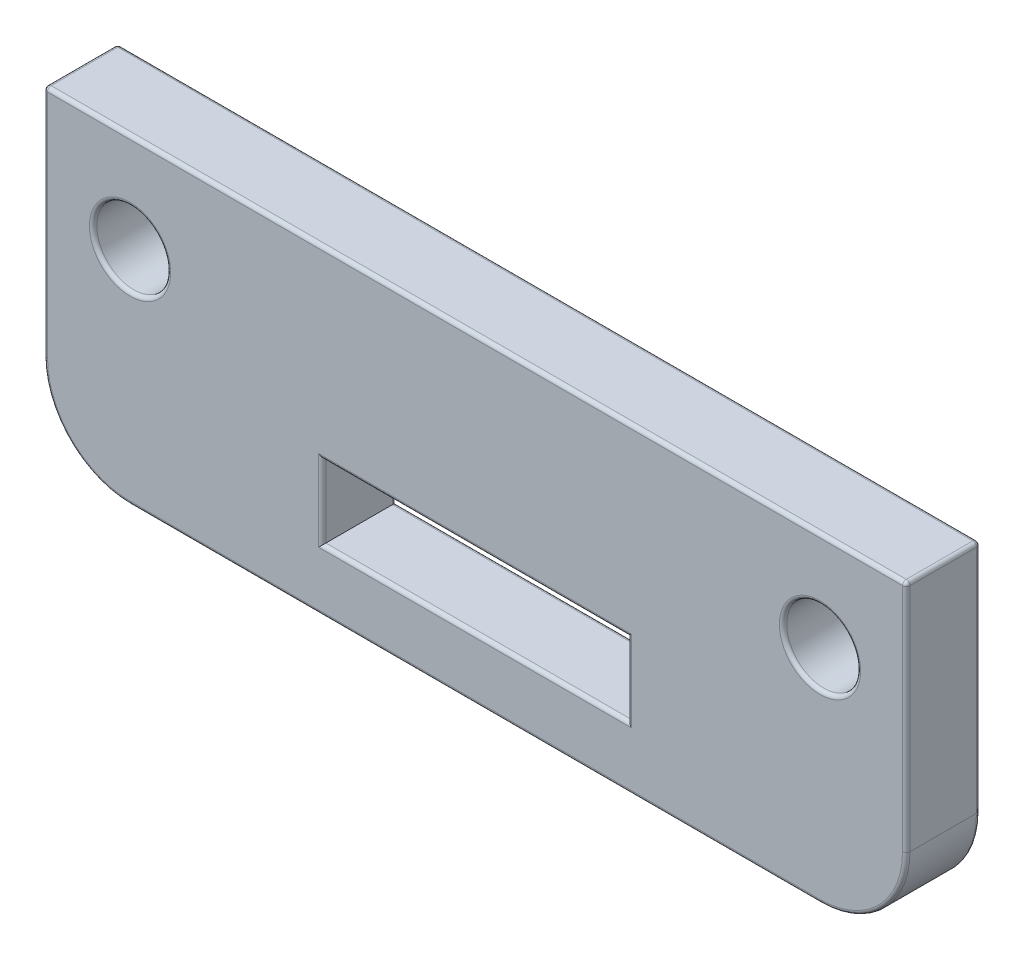
ISO-10303-21;
HEADER;
FILE_DESCRIPTION(('STEP AP214'),'2;1');
FILE_NAME('part.step','',(''),(''),'','','');
FILE_SCHEMA(('AUTOMOTIVE_DESIGN { 1 0 10303 214 1 1 1 1 }'));
ENDSEC;
DATA;
#1=APPLICATION_CONTEXT('core data for automotive mechanical design processes');
#2=APPLICATION_PROTOCOL_DEFINITION('international standard','automotive_design',2000,#1);
#3=PRODUCT_CONTEXT('',#1,'mechanical');
#4=PRODUCT('Part','Part','',(#3));
#5=PRODUCT_RELATED_PRODUCT_CATEGORY('part','',(#4));
#6=PRODUCT_DEFINITION_FORMATION('','',#4);
#7=PRODUCT_DEFINITION_CONTEXT('part definition',#1,'design');
#8=PRODUCT_DEFINITION('design','',#6,#7);
#9=PRODUCT_DEFINITION_SHAPE('','',#8);
#10=(LENGTH_UNIT() NAMED_UNIT(*) SI_UNIT(.MILLI.,.METRE.));
#11=(NAMED_UNIT(*) PLANE_ANGLE_UNIT() SI_UNIT($,.RADIAN.));
#12=(NAMED_UNIT(*) SI_UNIT($,.STERADIAN.) SOLID_ANGLE_UNIT());
#13=UNCERTAINTY_MEASURE_WITH_UNIT(LENGTH_MEASURE(1.E-05),#10,'distance_accuracy_value','');
#14=(GEOMETRIC_REPRESENTATION_CONTEXT(3) GLOBAL_UNCERTAINTY_ASSIGNED_CONTEXT((#13)) GLOBAL_UNIT_ASSIGNED_CONTEXT((#10,
#11,#12)) REPRESENTATION_CONTEXT('',''));
#15=CARTESIAN_POINT('',(0.,0.,0.));
#16=DIRECTION('',(0.,0.,1.));
#17=DIRECTION('',(1.,0.,0.));
#18=AXIS2_PLACEMENT_3D('',#15,#16,#17);
#19=CARTESIAN_POINT('',(0.,8.49264705882353,3.));
#20=DIRECTION('',(0.,0.,-1.));
#21=DIRECTION('',(-1.,0.,0.));
#22=AXIS2_PLACEMENT_3D('',#19,#20,#21);
#23=PLANE('',#22);
#24=CARTESIAN_POINT('',(14.,-15.5,3.));
#25=DIRECTION('',(0.,0.,-1.));
#26=DIRECTION('',(-1.,0.,0.));
#27=AXIS2_PLACEMENT_3D('',#24,#25,#26);
#28=CIRCLE('',#27,3.35);
#29=CARTESIAN_POINT('',(14.,-18.85,3.));
#30=VERTEX_POINT('',#29);
#31=CARTESIAN_POINT('',(17.35,-15.5,3.));
#32=VERTEX_POINT('',#31);
#33=EDGE_CURVE('E52',#30,#32,#28,.F.);
#34=ORIENTED_EDGE('',*,*,#33,.T.);
#35=DIRECTION('',(0.,1.,0.));
#36=VECTOR('',#35,1.);
#37=CARTESIAN_POINT('',(17.35,8.49264705882353,3.));
#38=LINE('',#37,#36);
#39=CARTESIAN_POINT('',(17.35,-6.15,3.));
#40=VERTEX_POINT('',#39);
#41=EDGE_CURVE('E11',#32,#40,#38,.T.);
#42=ORIENTED_EDGE('',*,*,#41,.T.);
#43=DIRECTION('',(1.,0.,0.));
#44=VECTOR('',#43,1.);
#45=CARTESIAN_POINT('',(-17.5,-6.15,3.));
#46=LINE('',#45,#44);
#47=CARTESIAN_POINT('',(-17.35,-6.15,3.));
#48=VERTEX_POINT('',#47);
#49=EDGE_CURVE('E383',#40,#48,#46,.F.);
#50=ORIENTED_EDGE('',*,*,#49,.T.);
#51=DIRECTION('',(0.,-1.,0.));
#52=VECTOR('',#51,1.);
#53=CARTESIAN_POINT('',(-17.35,8.49264705882353,3.));
#54=LINE('',#53,#52);
#55=CARTESIAN_POINT('',(-17.35,-15.5,3.));
#56=VERTEX_POINT('',#55);
#57=EDGE_CURVE('E386',#48,#56,#54,.T.);
#58=ORIENTED_EDGE('',*,*,#57,.T.);
#59=CARTESIAN_POINT('',(-14.,-15.5,3.));
#60=DIRECTION('',(0.,0.,-1.));
#61=DIRECTION('',(-1.,0.,0.));
#62=AXIS2_PLACEMENT_3D('',#59,#60,#61);
#63=CIRCLE('',#62,3.35);
#64=CARTESIAN_POINT('',(-14.,-18.85,3.));
#65=VERTEX_POINT('',#64);
#66=EDGE_CURVE('E389',#56,#65,#63,.F.);
#67=ORIENTED_EDGE('',*,*,#66,.T.);
#68=DIRECTION('',(1.,0.,0.));
#69=VECTOR('',#68,1.);
#70=CARTESIAN_POINT('',(0.,-18.85,3.));
#71=LINE('',#70,#69);
#72=EDGE_CURVE('E63',#65,#30,#71,.T.);
#73=ORIENTED_EDGE('',*,*,#72,.T.);
#74=EDGE_LOOP('',(#34,#42,#50,#58,#67,#73));
#75=FACE_BOUND('',#74,.T.);
#76=CARTESIAN_POINT('',(-14.,-10.,3.));
#77=DIRECTION('',(0.,0.,-1.));
#78=DIRECTION('',(-1.,0.,0.));
#79=AXIS2_PLACEMENT_3D('',#76,#77,#78);
#80=CIRCLE('',#79,1.65);
#81=CARTESIAN_POINT('',(-15.65,-10.,3.));
#82=VERTEX_POINT('',#81);
#83=EDGE_CURVE('E379',#82,#82,#80,.T.);
#84=ORIENTED_EDGE('',*,*,#83,.T.);
#85=EDGE_LOOP('',(#84));
#86=FACE_BOUND('',#85,.T.);
#87=DIRECTION('',(0.,1.,0.));
#88=VECTOR('',#87,1.);
#89=CARTESIAN_POINT('',(6.35,-16.5,3.));
#90=LINE('',#89,#88);
#91=CARTESIAN_POINT('',(6.35,-13.35,3.));
#92=VERTEX_POINT('',#91);
#93=CARTESIAN_POINT('',(6.35,-16.65,3.));
#94=VERTEX_POINT('',#93);
#95=EDGE_CURVE('E372',#92,#94,#90,.F.);
#96=ORIENTED_EDGE('',*,*,#95,.T.);
#97=DIRECTION('',(1.,0.,0.));
#98=VECTOR('',#97,1.);
#99=CARTESIAN_POINT('',(-6.2,-16.65,3.));
#100=LINE('',#99,#98);
#101=CARTESIAN_POINT('',(-6.35,-16.65,3.));
#102=VERTEX_POINT('',#101);
#103=EDGE_CURVE('E375',#94,#102,#100,.F.);
#104=ORIENTED_EDGE('',*,*,#103,.T.);
#105=DIRECTION('',(0.,-1.,0.));
#106=VECTOR('',#105,1.);
#107=CARTESIAN_POINT('',(-6.35,-13.5,3.));
#108=LINE('',#107,#106);
#109=CARTESIAN_POINT('',(-6.35,-13.35,3.));
#110=VERTEX_POINT('',#109);
#111=EDGE_CURVE('E366',#102,#110,#108,.F.);
#112=ORIENTED_EDGE('',*,*,#111,.T.);
#113=DIRECTION('',(-1.,0.,0.));
#114=VECTOR('',#113,1.);
#115=CARTESIAN_POINT('',(6.2,-13.35,3.));
#116=LINE('',#115,#114);
#117=EDGE_CURVE('E369',#110,#92,#116,.F.);
#118=ORIENTED_EDGE('',*,*,#117,.T.);
#119=EDGE_LOOP('',(#96,#104,#112,#118));
#120=FACE_BOUND('',#119,.T.);
#121=CARTESIAN_POINT('',(14.,-10.,3.));
#122=DIRECTION('',(0.,0.,-1.));
#123=DIRECTION('',(-1.,0.,0.));
#124=AXIS2_PLACEMENT_3D('',#121,#122,#123);
#125=CIRCLE('',#124,1.65);
#126=CARTESIAN_POINT('',(12.35,-10.,3.));
#127=VERTEX_POINT('',#126);
#128=EDGE_CURVE('E362',#127,#127,#125,.T.);
#129=ORIENTED_EDGE('',*,*,#128,.T.);
#130=EDGE_LOOP('',(#129));
#131=FACE_BOUND('',#130,.T.);
#132=ADVANCED_FACE('F42',(#75,#86,#120,#131),#23,.F.);
#133=CARTESIAN_POINT('',(0.,8.49264705882353,0.));
#134=DIRECTION('',(0.,0.,-1.));
#135=DIRECTION('',(-1.,0.,0.));
#136=AXIS2_PLACEMENT_3D('',#133,#134,#135);
#137=PLANE('',#136);
#138=DIRECTION('',(1.,0.,0.));
#139=VECTOR('',#138,1.);
#140=CARTESIAN_POINT('',(-14.,-18.85,0.));
#141=LINE('',#140,#139);
#142=CARTESIAN_POINT('',(14.,-18.85,0.));
#143=VERTEX_POINT('',#142);
#144=CARTESIAN_POINT('',(-14.,-18.85,0.));
#145=VERTEX_POINT('',#144);
#146=EDGE_CURVE('E295',#143,#145,#141,.F.);
#147=ORIENTED_EDGE('',*,*,#146,.T.);
#148=CARTESIAN_POINT('',(-14.,-15.5,0.));
#149=DIRECTION('',(0.,0.,-1.));
#150=DIRECTION('',(-1.,0.,0.));
#151=AXIS2_PLACEMENT_3D('',#148,#149,#150);
#152=CIRCLE('',#151,3.35);
#153=CARTESIAN_POINT('',(-17.35,-15.5,0.));
#154=VERTEX_POINT('',#153);
#155=EDGE_CURVE('E298',#145,#154,#152,.T.);
#156=ORIENTED_EDGE('',*,*,#155,.T.);
#157=DIRECTION('',(0.,-1.,0.));
#158=VECTOR('',#157,1.);
#159=CARTESIAN_POINT('',(-17.35,-6.,0.));
#160=LINE('',#159,#158);
#161=CARTESIAN_POINT('',(-17.35,-6.15,0.));
#162=VERTEX_POINT('',#161);
#163=EDGE_CURVE('E283',#154,#162,#160,.F.);
#164=ORIENTED_EDGE('',*,*,#163,.T.);
#165=DIRECTION('',(1.,0.,0.));
#166=VECTOR('',#165,1.);
#167=CARTESIAN_POINT('',(0.,-6.15,0.));
#168=LINE('',#167,#166);
#169=CARTESIAN_POINT('',(17.35,-6.15,0.));
#170=VERTEX_POINT('',#169);
#171=EDGE_CURVE('E286',#162,#170,#168,.T.);
#172=ORIENTED_EDGE('',*,*,#171,.T.);
#173=DIRECTION('',(0.,1.,0.));
#174=VECTOR('',#173,1.);
#175=CARTESIAN_POINT('',(17.35,-15.5,0.));
#176=LINE('',#175,#174);
#177=CARTESIAN_POINT('',(17.35,-15.5,0.));
#178=VERTEX_POINT('',#177);
#179=EDGE_CURVE('E289',#170,#178,#176,.F.);
#180=ORIENTED_EDGE('',*,*,#179,.T.);
#181=CARTESIAN_POINT('',(14.,-15.5,0.));
#182=DIRECTION('',(0.,0.,-1.));
#183=DIRECTION('',(-1.,0.,0.));
#184=AXIS2_PLACEMENT_3D('',#181,#182,#183);
#185=CIRCLE('',#184,3.35);
#186=EDGE_CURVE('E292',#178,#143,#185,.T.);
#187=ORIENTED_EDGE('',*,*,#186,.T.);
#188=EDGE_LOOP('',(#147,#156,#164,#172,#180,#187));
#189=FACE_BOUND('',#188,.T.);
#190=CARTESIAN_POINT('',(-14.,-10.,0.));
#191=DIRECTION('',(0.,0.,-1.));
#192=DIRECTION('',(-1.,0.,0.));
#193=AXIS2_PLACEMENT_3D('',#190,#191,#192);
#194=CIRCLE('',#193,1.65);
#195=CARTESIAN_POINT('',(-15.65,-10.,0.));
#196=VERTEX_POINT('',#195);
#197=EDGE_CURVE('E279',#196,#196,#194,.F.);
#198=ORIENTED_EDGE('',*,*,#197,.T.);
#199=EDGE_LOOP('',(#198));
#200=FACE_BOUND('',#199,.T.);
#201=DIRECTION('',(1.,0.,0.));
#202=VECTOR('',#201,1.);
#203=CARTESIAN_POINT('',(0.,-16.65,0.));
#204=LINE('',#203,#202);
#205=CARTESIAN_POINT('',(-6.35,-16.65,0.));
#206=VERTEX_POINT('',#205);
#207=CARTESIAN_POINT('',(6.35,-16.65,0.));
#208=VERTEX_POINT('',#207);
#209=EDGE_CURVE('E272',#206,#208,#204,.T.);
#210=ORIENTED_EDGE('',*,*,#209,.T.);
#211=DIRECTION('',(0.,1.,0.));
#212=VECTOR('',#211,1.);
#213=CARTESIAN_POINT('',(6.35,8.49264705882353,0.));
#214=LINE('',#213,#212);
#215=CARTESIAN_POINT('',(6.35,-13.35,0.));
#216=VERTEX_POINT('',#215);
#217=EDGE_CURVE('E275',#208,#216,#214,.T.);
#218=ORIENTED_EDGE('',*,*,#217,.T.);
#219=DIRECTION('',(-1.,0.,0.));
#220=VECTOR('',#219,1.);
#221=CARTESIAN_POINT('',(0.,-13.35,0.));
#222=LINE('',#221,#220);
#223=CARTESIAN_POINT('',(-6.35,-13.35,0.));
#224=VERTEX_POINT('',#223);
#225=EDGE_CURVE('E266',#216,#224,#222,.T.);
#226=ORIENTED_EDGE('',*,*,#225,.T.);
#227=DIRECTION('',(0.,-1.,0.));
#228=VECTOR('',#227,1.);
#229=CARTESIAN_POINT('',(-6.35,8.49264705882353,0.));
#230=LINE('',#229,#228);
#231=EDGE_CURVE('E269',#224,#206,#230,.T.);
#232=ORIENTED_EDGE('',*,*,#231,.T.);
#233=EDGE_LOOP('',(#210,#218,#226,#232));
#234=FACE_BOUND('',#233,.T.);
#235=CARTESIAN_POINT('',(14.,-10.,0.));
#236=DIRECTION('',(0.,0.,-1.));
#237=DIRECTION('',(-1.,0.,0.));
#238=AXIS2_PLACEMENT_3D('',#235,#236,#237);
#239=CIRCLE('',#238,1.65);
#240=CARTESIAN_POINT('',(12.35,-10.,0.));
#241=VERTEX_POINT('',#240);
#242=EDGE_CURVE('E262',#241,#241,#239,.F.);
#243=ORIENTED_EDGE('',*,*,#242,.T.);
#244=EDGE_LOOP('',(#243));
#245=FACE_BOUND('',#244,.T.);
#246=ADVANCED_FACE('F585',(#189,#200,#234,#245),#137,.T.);
#247=CARTESIAN_POINT('',(-17.5,9.,3.));
#248=DIRECTION('',(1.,0.,0.));
#249=DIRECTION('',(0.,0.,-1.));
#250=AXIS2_PLACEMENT_3D('',#247,#248,#249);
#251=PLANE('',#250);
#252=DIRECTION('',(0.,0.,1.));
#253=VECTOR('',#252,1.);
#254=CARTESIAN_POINT('',(-17.5,-6.15,0.));
#255=LINE('',#254,#253);
#256=CARTESIAN_POINT('',(-17.5,-6.15,2.85));
#257=VERTEX_POINT('',#256);
#258=CARTESIAN_POINT('',(-17.5,-6.15,0.15));
#259=VERTEX_POINT('',#258);
#260=EDGE_CURVE('E211',#257,#259,#255,.F.);
#261=ORIENTED_EDGE('',*,*,#260,.T.);
#262=DIRECTION('',(0.,-1.,0.));
#263=VECTOR('',#262,1.);
#264=CARTESIAN_POINT('',(-17.5,-15.5,0.15));
#265=LINE('',#264,#263);
#266=CARTESIAN_POINT('',(-17.5,-15.5,0.15));
#267=VERTEX_POINT('',#266);
#268=EDGE_CURVE('E259',#259,#267,#265,.T.);
#269=ORIENTED_EDGE('',*,*,#268,.T.);
#270=DIRECTION('',(0.,0.,-1.));
#271=VECTOR('',#270,1.);
#272=CARTESIAN_POINT('',(-17.5,-15.5,3.));
#273=LINE('',#272,#271);
#274=CARTESIAN_POINT('',(-17.5,-15.5,2.85));
#275=VERTEX_POINT('',#274);
#276=EDGE_CURVE('E232',#267,#275,#273,.F.);
#277=ORIENTED_EDGE('',*,*,#276,.T.);
#278=DIRECTION('',(0.,-1.,0.));
#279=VECTOR('',#278,1.);
#280=CARTESIAN_POINT('',(-17.5,9.,2.85));
#281=LINE('',#280,#279);
#282=EDGE_CURVE('E254',#275,#257,#281,.F.);
#283=ORIENTED_EDGE('',*,*,#282,.T.);
#284=EDGE_LOOP('',(#261,#269,#277,#283));
#285=FACE_BOUND('',#284,.T.);
#286=ADVANCED_FACE('F570',(#285),#251,.F.);
#287=CARTESIAN_POINT('',(17.5,9.,3.));
#288=DIRECTION('',(-1.,0.,0.));
#289=DIRECTION('',(0.,0.,1.));
#290=AXIS2_PLACEMENT_3D('',#287,#288,#289);
#291=PLANE('',#290);
#292=DIRECTION('',(0.,0.,-1.));
#293=VECTOR('',#292,1.);
#294=CARTESIAN_POINT('',(17.5,-15.5,3.));
#295=LINE('',#294,#293);
#296=CARTESIAN_POINT('',(17.5,-15.5,2.85));
#297=VERTEX_POINT('',#296);
#298=CARTESIAN_POINT('',(17.5,-15.5,0.15));
#299=VERTEX_POINT('',#298);
#300=EDGE_CURVE('E523',#297,#299,#295,.T.);
#301=ORIENTED_EDGE('',*,*,#300,.T.);
#302=DIRECTION('',(0.,1.,0.));
#303=VECTOR('',#302,1.);
#304=CARTESIAN_POINT('',(17.5,-6.,0.15));
#305=LINE('',#304,#303);
#306=CARTESIAN_POINT('',(17.5,-6.15,0.15));
#307=VERTEX_POINT('',#306);
#308=EDGE_CURVE('E251',#299,#307,#305,.T.);
#309=ORIENTED_EDGE('',*,*,#308,.T.);
#310=DIRECTION('',(0.,0.,-1.));
#311=VECTOR('',#310,1.);
#312=CARTESIAN_POINT('',(17.5,-6.15,3.));
#313=LINE('',#312,#311);
#314=CARTESIAN_POINT('',(17.5,-6.15,2.85));
#315=VERTEX_POINT('',#314);
#316=EDGE_CURVE('E247',#307,#315,#313,.F.);
#317=ORIENTED_EDGE('',*,*,#316,.T.);
#318=DIRECTION('',(0.,1.,0.));
#319=VECTOR('',#318,1.);
#320=CARTESIAN_POINT('',(17.5,9.,2.85));
#321=LINE('',#320,#319);
#322=EDGE_CURVE('E244',#315,#297,#321,.F.);
#323=ORIENTED_EDGE('',*,*,#322,.T.);
#324=EDGE_LOOP('',(#301,#309,#317,#323));
#325=FACE_BOUND('',#324,.T.);
#326=ADVANCED_FACE('F621',(#325),#291,.F.);
#327=CARTESIAN_POINT('',(-17.5,-19.,3.));
#328=DIRECTION('',(0.,1.,0.));
#329=DIRECTION('',(0.,0.,1.));
#330=AXIS2_PLACEMENT_3D('',#327,#328,#329);
#331=PLANE('',#330);
#332=DIRECTION('',(0.,0.,-1.));
#333=VECTOR('',#332,1.);
#334=CARTESIAN_POINT('',(-14.,-19.,3.));
#335=LINE('',#334,#333);
#336=CARTESIAN_POINT('',(-14.,-19.,2.85));
#337=VERTEX_POINT('',#336);
#338=CARTESIAN_POINT('',(-14.,-19.,0.15));
#339=VERTEX_POINT('',#338);
#340=EDGE_CURVE('E531',#337,#339,#335,.T.);
#341=ORIENTED_EDGE('',*,*,#340,.T.);
#342=DIRECTION('',(1.,0.,0.));
#343=VECTOR('',#342,1.);
#344=CARTESIAN_POINT('',(14.,-19.,0.15));
#345=LINE('',#344,#343);
#346=CARTESIAN_POINT('',(14.,-19.,0.15));
#347=VERTEX_POINT('',#346);
#348=EDGE_CURVE('E311',#339,#347,#345,.T.);
#349=ORIENTED_EDGE('',*,*,#348,.T.);
#350=DIRECTION('',(0.,0.,-1.));
#351=VECTOR('',#350,1.);
#352=CARTESIAN_POINT('',(14.,-19.,3.));
#353=LINE('',#352,#351);
#354=CARTESIAN_POINT('',(14.,-19.,2.85));
#355=VERTEX_POINT('',#354);
#356=EDGE_CURVE('E236',#347,#355,#353,.F.);
#357=ORIENTED_EDGE('',*,*,#356,.T.);
#358=DIRECTION('',(1.,0.,0.));
#359=VECTOR('',#358,1.);
#360=CARTESIAN_POINT('',(-17.5,-19.,2.85));
#361=LINE('',#360,#359);
#362=EDGE_CURVE('E308',#355,#337,#361,.F.);
#363=ORIENTED_EDGE('',*,*,#362,.T.);
#364=EDGE_LOOP('',(#341,#349,#357,#363));
#365=FACE_BOUND('',#364,.T.);
#366=ADVANCED_FACE('F539',(#365),#331,.F.);
#367=CARTESIAN_POINT('',(11.5,-6.,3.));
#368=DIRECTION('',(0.,1.,0.));
#369=DIRECTION('',(-1.,0.,0.));
#370=AXIS2_PLACEMENT_3D('',#367,#368,#369);
#371=PLANE('',#370);
#372=DIRECTION('',(0.,0.,-1.));
#373=VECTOR('',#372,1.);
#374=CARTESIAN_POINT('',(17.35,-6.,0.));
#375=LINE('',#374,#373);
#376=CARTESIAN_POINT('',(17.35,-6.,2.85));
#377=VERTEX_POINT('',#376);
#378=CARTESIAN_POINT('',(17.35,-6.,0.15));
#379=VERTEX_POINT('',#378);
#380=EDGE_CURVE('E204',#377,#379,#375,.T.);
#381=ORIENTED_EDGE('',*,*,#380,.T.);
#382=DIRECTION('',(1.,0.,0.));
#383=VECTOR('',#382,1.);
#384=CARTESIAN_POINT('',(11.5,-6.,0.15));
#385=LINE('',#384,#383);
#386=CARTESIAN_POINT('',(-17.35,-6.,0.15));
#387=VERTEX_POINT('',#386);
#388=EDGE_CURVE('E199',#379,#387,#385,.F.);
#389=ORIENTED_EDGE('',*,*,#388,.T.);
#390=DIRECTION('',(0.,0.,1.));
#391=VECTOR('',#390,1.);
#392=CARTESIAN_POINT('',(-17.35,-6.,3.));
#393=LINE('',#392,#391);
#394=CARTESIAN_POINT('',(-17.35,-6.,2.85));
#395=VERTEX_POINT('',#394);
#396=EDGE_CURVE('E191',#387,#395,#393,.T.);
#397=ORIENTED_EDGE('',*,*,#396,.T.);
#398=DIRECTION('',(1.,0.,0.));
#399=VECTOR('',#398,1.);
#400=CARTESIAN_POINT('',(17.5,-6.,2.85));
#401=LINE('',#400,#399);
#402=EDGE_CURVE('E196',#395,#377,#401,.T.);
#403=ORIENTED_EDGE('',*,*,#402,.T.);
#404=EDGE_LOOP('',(#381,#389,#397,#403));
#405=FACE_BOUND('',#404,.T.);
#406=ADVANCED_FACE('F194',(#405),#371,.T.);
#407=CARTESIAN_POINT('',(-14.,-10.,3.));
#408=DIRECTION('',(0.,0.,-1.));
#409=DIRECTION('',(-1.,0.,0.));
#410=AXIS2_PLACEMENT_3D('',#407,#408,#409);
#411=CYLINDRICAL_SURFACE('',#410,1.5);
#412=CARTESIAN_POINT('',(-14.,-10.,0.15));
#413=DIRECTION('',(0.,0.,-1.));
#414=DIRECTION('',(-1.,0.,0.));
#415=AXIS2_PLACEMENT_3D('',#412,#413,#414);
#416=CIRCLE('',#415,1.5);
#417=CARTESIAN_POINT('',(-15.5,-10.,0.15));
#418=VERTEX_POINT('',#417);
#419=EDGE_CURVE('E324',#418,#418,#416,.T.);
#420=ORIENTED_EDGE('',*,*,#419,.T.);
#421=EDGE_LOOP('',(#420));
#422=FACE_BOUND('',#421,.T.);
#423=CARTESIAN_POINT('',(-14.,-10.,2.85));
#424=DIRECTION('',(0.,0.,-1.));
#425=DIRECTION('',(-1.,0.,0.));
#426=AXIS2_PLACEMENT_3D('',#423,#424,#425);
#427=CIRCLE('',#426,1.5);
#428=CARTESIAN_POINT('',(-15.5,-10.,2.85));
#429=VERTEX_POINT('',#428);
#430=EDGE_CURVE('E320',#429,#429,#427,.F.);
#431=ORIENTED_EDGE('',*,*,#430,.T.);
#432=EDGE_LOOP('',(#431));
#433=FACE_BOUND('',#432,.T.);
#434=ADVANCED_FACE('F953',(#422,#433),#411,.F.);
#435=CARTESIAN_POINT('',(-6.2,-13.5,3.));
#436=DIRECTION('',(1.,0.,0.));
#437=DIRECTION('',(0.,0.,-1.));
#438=AXIS2_PLACEMENT_3D('',#435,#436,#437);
#439=PLANE('',#438);
#440=DIRECTION('',(0.,0.,-1.));
#441=VECTOR('',#440,1.);
#442=CARTESIAN_POINT('',(-6.2,-16.5,3.));
#443=LINE('',#442,#441);
#444=CARTESIAN_POINT('',(-6.2,-16.5,2.85));
#445=VERTEX_POINT('',#444);
#446=CARTESIAN_POINT('',(-6.2,-16.5,0.15));
#447=VERTEX_POINT('',#446);
#448=EDGE_CURVE('E515',#445,#447,#443,.T.);
#449=ORIENTED_EDGE('',*,*,#448,.T.);
#450=DIRECTION('',(0.,-1.,0.));
#451=VECTOR('',#450,1.);
#452=CARTESIAN_POINT('',(-6.2,-13.5,0.15));
#453=LINE('',#452,#451);
#454=CARTESIAN_POINT('',(-6.2,-13.5,0.15));
#455=VERTEX_POINT('',#454);
#456=EDGE_CURVE('E345',#447,#455,#453,.F.);
#457=ORIENTED_EDGE('',*,*,#456,.T.);
#458=DIRECTION('',(0.,0.,-1.));
#459=VECTOR('',#458,1.);
#460=CARTESIAN_POINT('',(-6.2,-13.5,3.));
#461=LINE('',#460,#459);
#462=CARTESIAN_POINT('',(-6.2,-13.5,2.85));
#463=VERTEX_POINT('',#462);
#464=EDGE_CURVE('E459',#463,#455,#461,.T.);
#465=ORIENTED_EDGE('',*,*,#464,.F.);
#466=DIRECTION('',(0.,-1.,0.));
#467=VECTOR('',#466,1.);
#468=CARTESIAN_POINT('',(-6.2,-16.5,2.85));
#469=LINE('',#468,#467);
#470=EDGE_CURVE('E342',#463,#445,#469,.T.);
#471=ORIENTED_EDGE('',*,*,#470,.T.);
#472=EDGE_LOOP('',(#449,#457,#465,#471));
#473=FACE_BOUND('',#472,.T.);
#474=ADVANCED_FACE('F1033',(#473),#439,.T.);
#475=CARTESIAN_POINT('',(-6.2,-16.5,3.));
#476=DIRECTION('',(0.,1.,0.));
#477=DIRECTION('',(0.,0.,1.));
#478=AXIS2_PLACEMENT_3D('',#475,#476,#477);
#479=PLANE('',#478);
#480=DIRECTION('',(0.,0.,-1.));
#481=VECTOR('',#480,1.);
#482=CARTESIAN_POINT('',(6.2,-16.5,3.));
#483=LINE('',#482,#481);
#484=CARTESIAN_POINT('',(6.2,-16.5,2.85));
#485=VERTEX_POINT('',#484);
#486=CARTESIAN_POINT('',(6.2,-16.5,0.15));
#487=VERTEX_POINT('',#486);
#488=EDGE_CURVE('E513',#485,#487,#483,.T.);
#489=ORIENTED_EDGE('',*,*,#488,.T.);
#490=DIRECTION('',(1.,0.,0.));
#491=VECTOR('',#490,1.);
#492=CARTESIAN_POINT('',(-6.2,-16.5,0.15));
#493=LINE('',#492,#491);
#494=EDGE_CURVE('E339',#487,#447,#493,.F.);
#495=ORIENTED_EDGE('',*,*,#494,.T.);
#496=ORIENTED_EDGE('',*,*,#448,.F.);
#497=DIRECTION('',(1.,0.,0.));
#498=VECTOR('',#497,1.);
#499=CARTESIAN_POINT('',(6.2,-16.5,2.85));
#500=LINE('',#499,#498);
#501=EDGE_CURVE('E335',#445,#485,#500,.T.);
#502=ORIENTED_EDGE('',*,*,#501,.T.);
#503=EDGE_LOOP('',(#489,#495,#496,#502));
#504=FACE_BOUND('',#503,.T.);
#505=ADVANCED_FACE('F512',(#504),#479,.T.);
#506=CARTESIAN_POINT('',(6.2,-13.5,3.));
#507=DIRECTION('',(-1.,0.,0.));
#508=DIRECTION('',(0.,0.,1.));
#509=AXIS2_PLACEMENT_3D('',#506,#507,#508);
#510=PLANE('',#509);
#511=DIRECTION('',(0.,0.,-1.));
#512=VECTOR('',#511,1.);
#513=CARTESIAN_POINT('',(6.2,-13.5,3.));
#514=LINE('',#513,#512);
#515=CARTESIAN_POINT('',(6.2,-13.5,2.85));
#516=VERTEX_POINT('',#515);
#517=CARTESIAN_POINT('',(6.2,-13.5,0.15));
#518=VERTEX_POINT('',#517);
#519=EDGE_CURVE('E519',#516,#518,#514,.T.);
#520=ORIENTED_EDGE('',*,*,#519,.T.);
#521=DIRECTION('',(0.,1.,0.));
#522=VECTOR('',#521,1.);
#523=CARTESIAN_POINT('',(6.2,-13.5,0.15));
#524=LINE('',#523,#522);
#525=EDGE_CURVE('E331',#518,#487,#524,.F.);
#526=ORIENTED_EDGE('',*,*,#525,.T.);
#527=ORIENTED_EDGE('',*,*,#488,.F.);
#528=DIRECTION('',(0.,1.,0.));
#529=VECTOR('',#528,1.);
#530=CARTESIAN_POINT('',(6.2,-13.5,2.85));
#531=LINE('',#530,#529);
#532=EDGE_CURVE('E328',#485,#516,#531,.T.);
#533=ORIENTED_EDGE('',*,*,#532,.T.);
#534=EDGE_LOOP('',(#520,#526,#527,#533));
#535=FACE_BOUND('',#534,.T.);
#536=ADVANCED_FACE('F516',(#535),#510,.T.);
#537=CARTESIAN_POINT('',(-6.2,-13.5,3.));
#538=DIRECTION('',(0.,-1.,0.));
#539=DIRECTION('',(0.,0.,-1.));
#540=AXIS2_PLACEMENT_3D('',#537,#538,#539);
#541=PLANE('',#540);
#542=ORIENTED_EDGE('',*,*,#464,.T.);
#543=DIRECTION('',(-1.,0.,0.));
#544=VECTOR('',#543,1.);
#545=CARTESIAN_POINT('',(-6.2,-13.5,0.15));
#546=LINE('',#545,#544);
#547=EDGE_CURVE('E351',#455,#518,#546,.F.);
#548=ORIENTED_EDGE('',*,*,#547,.T.);
#549=ORIENTED_EDGE('',*,*,#519,.F.);
#550=DIRECTION('',(-1.,0.,0.));
#551=VECTOR('',#550,1.);
#552=CARTESIAN_POINT('',(-6.2,-13.5,2.85));
#553=LINE('',#552,#551);
#554=EDGE_CURVE('E348',#516,#463,#553,.T.);
#555=ORIENTED_EDGE('',*,*,#554,.T.);
#556=EDGE_LOOP('',(#542,#548,#549,#555));
#557=FACE_BOUND('',#556,.T.);
#558=ADVANCED_FACE('F1003',(#557),#541,.T.);
#559=CARTESIAN_POINT('',(14.,-10.,3.));
#560=DIRECTION('',(0.,0.,-1.));
#561=DIRECTION('',(-1.,0.,0.));
#562=AXIS2_PLACEMENT_3D('',#559,#560,#561);
#563=CYLINDRICAL_SURFACE('',#562,1.5);
#564=CARTESIAN_POINT('',(14.,-10.,0.15));
#565=DIRECTION('',(0.,0.,-1.));
#566=DIRECTION('',(-1.,0.,0.));
#567=AXIS2_PLACEMENT_3D('',#564,#565,#566);
#568=CIRCLE('',#567,1.5);
#569=CARTESIAN_POINT('',(12.5,-10.,0.15));
#570=VERTEX_POINT('',#569);
#571=EDGE_CURVE('E358',#570,#570,#568,.T.);
#572=ORIENTED_EDGE('',*,*,#571,.T.);
#573=EDGE_LOOP('',(#572));
#574=FACE_BOUND('',#573,.T.);
#575=CARTESIAN_POINT('',(14.,-10.,2.85));
#576=DIRECTION('',(0.,0.,-1.));
#577=DIRECTION('',(-1.,0.,0.));
#578=AXIS2_PLACEMENT_3D('',#575,#576,#577);
#579=CIRCLE('',#578,1.5);
#580=CARTESIAN_POINT('',(12.5,-10.,2.85));
#581=VERTEX_POINT('',#580);
#582=EDGE_CURVE('E354',#581,#581,#579,.F.);
#583=ORIENTED_EDGE('',*,*,#582,.T.);
#584=EDGE_LOOP('',(#583));
#585=FACE_BOUND('',#584,.T.);
#586=ADVANCED_FACE('F632',(#574,#585),#563,.F.);
#587=CARTESIAN_POINT('',(14.,-15.5,3.));
#588=DIRECTION('',(0.,0.,-1.));
#589=DIRECTION('',(-1.,0.,0.));
#590=AXIS2_PLACEMENT_3D('',#587,#588,#589);
#591=CYLINDRICAL_SURFACE('',#590,3.5);
#592=ORIENTED_EDGE('',*,*,#356,.F.);
#593=CARTESIAN_POINT('',(14.,-15.5,0.15));
#594=DIRECTION('',(0.,0.,-1.));
#595=DIRECTION('',(-1.,0.,0.));
#596=AXIS2_PLACEMENT_3D('',#593,#594,#595);
#597=CIRCLE('',#596,3.5);
#598=EDGE_CURVE('E317',#347,#299,#597,.F.);
#599=ORIENTED_EDGE('',*,*,#598,.T.);
#600=ORIENTED_EDGE('',*,*,#300,.F.);
#601=CARTESIAN_POINT('',(14.,-15.5,2.85));
#602=DIRECTION('',(0.,0.,-1.));
#603=DIRECTION('',(-1.,0.,0.));
#604=AXIS2_PLACEMENT_3D('',#601,#602,#603);
#605=CIRCLE('',#604,3.5);
#606=EDGE_CURVE('E314',#297,#355,#605,.T.);
#607=ORIENTED_EDGE('',*,*,#606,.T.);
#608=EDGE_LOOP('',(#592,#599,#600,#607));
#609=FACE_BOUND('',#608,.T.);
#610=ADVANCED_FACE('F629',(#609),#591,.T.);
#611=CARTESIAN_POINT('',(-14.,-15.5,3.));
#612=DIRECTION('',(0.,0.,-1.));
#613=DIRECTION('',(-1.,0.,0.));
#614=AXIS2_PLACEMENT_3D('',#611,#612,#613);
#615=CYLINDRICAL_SURFACE('',#614,3.5);
#616=ORIENTED_EDGE('',*,*,#276,.F.);
#617=CARTESIAN_POINT('',(-14.,-15.5,0.15));
#618=DIRECTION('',(0.,0.,-1.));
#619=DIRECTION('',(-1.,0.,0.));
#620=AXIS2_PLACEMENT_3D('',#617,#618,#619);
#621=CIRCLE('',#620,3.5);
#622=EDGE_CURVE('E305',#267,#339,#621,.F.);
#623=ORIENTED_EDGE('',*,*,#622,.T.);
#624=ORIENTED_EDGE('',*,*,#340,.F.);
#625=CARTESIAN_POINT('',(-14.,-15.5,2.85));
#626=DIRECTION('',(0.,0.,-1.));
#627=DIRECTION('',(-1.,0.,0.));
#628=AXIS2_PLACEMENT_3D('',#625,#626,#627);
#629=CIRCLE('',#628,3.5);
#630=EDGE_CURVE('E302',#337,#275,#629,.T.);
#631=ORIENTED_EDGE('',*,*,#630,.T.);
#632=EDGE_LOOP('',(#616,#623,#624,#631));
#633=FACE_BOUND('',#632,.T.);
#634=ADVANCED_FACE('F567',(#633),#615,.T.);
#635=CARTESIAN_POINT('',(-14.,-15.5,2.85));
#636=DIRECTION('',(0.,0.,-1.));
#637=DIRECTION('',(-1.,0.,0.));
#638=AXIS2_PLACEMENT_3D('',#635,#636,#637);
#639=TOROIDAL_SURFACE('',#638,3.35,0.15);
#640=CARTESIAN_POINT('',(-17.35,-15.5,2.85));
#641=DIRECTION('',(0.,1.,0.));
#642=DIRECTION('',(0.,0.,1.));
#643=AXIS2_PLACEMENT_3D('',#640,#641,#642);
#644=CIRCLE('',#643,0.15);
#645=EDGE_CURVE('E451',#275,#56,#644,.T.);
#646=ORIENTED_EDGE('',*,*,#645,.F.);
#647=ORIENTED_EDGE('',*,*,#630,.F.);
#648=CARTESIAN_POINT('',(-14.,-18.85,2.85));
#649=DIRECTION('',(1.,0.,0.));
#650=DIRECTION('',(0.,0.,-1.));
#651=AXIS2_PLACEMENT_3D('',#648,#649,#650);
#652=CIRCLE('',#651,0.15);
#653=EDGE_CURVE('E455',#65,#337,#652,.T.);
#654=ORIENTED_EDGE('',*,*,#653,.F.);
#655=ORIENTED_EDGE('',*,*,#66,.F.);
#656=EDGE_LOOP('',(#646,#647,#654,#655));
#657=FACE_BOUND('',#656,.T.);
#658=ADVANCED_FACE('F564',(#657),#639,.T.);
#659=CARTESIAN_POINT('',(-14.,-15.5,0.15));
#660=DIRECTION('',(0.,0.,-1.));
#661=DIRECTION('',(-1.,0.,0.));
#662=AXIS2_PLACEMENT_3D('',#659,#660,#661);
#663=TOROIDAL_SURFACE('',#662,3.35,0.15);
#664=CARTESIAN_POINT('',(-14.,-18.85,0.15));
#665=DIRECTION('',(1.,0.,0.));
#666=DIRECTION('',(0.,0.,-1.));
#667=AXIS2_PLACEMENT_3D('',#664,#665,#666);
#668=CIRCLE('',#667,0.15);
#669=EDGE_CURVE('E443',#339,#145,#668,.T.);
#670=ORIENTED_EDGE('',*,*,#669,.F.);
#671=ORIENTED_EDGE('',*,*,#622,.F.);
#672=CARTESIAN_POINT('',(-17.35,-15.5,0.15));
#673=DIRECTION('',(0.,1.,0.));
#674=DIRECTION('',(0.,0.,1.));
#675=AXIS2_PLACEMENT_3D('',#672,#673,#674);
#676=CIRCLE('',#675,0.15);
#677=EDGE_CURVE('E447',#154,#267,#676,.T.);
#678=ORIENTED_EDGE('',*,*,#677,.F.);
#679=ORIENTED_EDGE('',*,*,#155,.F.);
#680=EDGE_LOOP('',(#670,#671,#678,#679));
#681=FACE_BOUND('',#680,.T.);
#682=ADVANCED_FACE('F603',(#681),#663,.T.);
#683=CARTESIAN_POINT('',(0.,-18.85,2.85));
#684=DIRECTION('',(1.,0.,0.));
#685=DIRECTION('',(0.,0.,-1.));
#686=AXIS2_PLACEMENT_3D('',#683,#684,#685);
#687=CYLINDRICAL_SURFACE('',#686,0.15);
#688=ORIENTED_EDGE('',*,*,#653,.T.);
#689=ORIENTED_EDGE('',*,*,#362,.F.);
#690=CARTESIAN_POINT('',(14.,-18.85,2.85));
#691=DIRECTION('',(1.,0.,0.));
#692=DIRECTION('',(0.,0.,-1.));
#693=AXIS2_PLACEMENT_3D('',#690,#691,#692);
#694=CIRCLE('',#693,0.15);
#695=EDGE_CURVE('E439',#30,#355,#694,.T.);
#696=ORIENTED_EDGE('',*,*,#695,.F.);
#697=ORIENTED_EDGE('',*,*,#72,.F.);
#698=EDGE_LOOP('',(#688,#689,#696,#697));
#699=FACE_BOUND('',#698,.T.);
#700=ADVANCED_FACE('F545',(#699),#687,.T.);
#701=CARTESIAN_POINT('',(-17.35,8.49264705882353,2.85));
#702=DIRECTION('',(0.,-1.,0.));
#703=DIRECTION('',(0.,0.,-1.));
#704=AXIS2_PLACEMENT_3D('',#701,#702,#703);
#705=CYLINDRICAL_SURFACE('',#704,0.15);
#706=ORIENTED_EDGE('',*,*,#645,.T.);
#707=ORIENTED_EDGE('',*,*,#57,.F.);
#708=CARTESIAN_POINT('',(-17.35,-6.15,2.85));
#709=DIRECTION('',(0.,1.,0.));
#710=DIRECTION('',(0.,0.,1.));
#711=AXIS2_PLACEMENT_3D('',#708,#709,#710);
#712=CIRCLE('',#711,0.15);
#713=EDGE_CURVE('E216',#257,#48,#712,.T.);
#714=ORIENTED_EDGE('',*,*,#713,.F.);
#715=ORIENTED_EDGE('',*,*,#282,.F.);
#716=EDGE_LOOP('',(#706,#707,#714,#715));
#717=FACE_BOUND('',#716,.T.);
#718=ADVANCED_FACE('F559',(#717),#705,.T.);
#719=CARTESIAN_POINT('',(-17.35,-6.15,3.));
#720=DIRECTION('',(0.,0.,-1.));
#721=DIRECTION('',(-1.,0.,0.));
#722=AXIS2_PLACEMENT_3D('',#719,#720,#721);
#723=CYLINDRICAL_SURFACE('',#722,0.15);
#724=CARTESIAN_POINT('',(-17.35,-6.15,0.15));
#725=DIRECTION('',(0.,0.,-1.));
#726=DIRECTION('',(0.,1.,0.));
#727=AXIS2_PLACEMENT_3D('',#724,#725,#726);
#728=CIRCLE('',#727,0.15);
#729=EDGE_CURVE('E217',#259,#387,#728,.T.);
#730=ORIENTED_EDGE('',*,*,#729,.F.);
#731=ORIENTED_EDGE('',*,*,#260,.F.);
#732=CARTESIAN_POINT('',(-17.35,-6.15,2.85));
#733=DIRECTION('',(0.,0.,1.));
#734=DIRECTION('',(1.,0.,0.));
#735=AXIS2_PLACEMENT_3D('',#732,#733,#734);
#736=CIRCLE('',#735,0.15);
#737=EDGE_CURVE('E208',#395,#257,#736,.T.);
#738=ORIENTED_EDGE('',*,*,#737,.F.);
#739=ORIENTED_EDGE('',*,*,#396,.F.);
#740=EDGE_LOOP('',(#730,#731,#738,#739));
#741=FACE_BOUND('',#740,.T.);
#742=ADVANCED_FACE('F210',(#741),#723,.T.);
#743=CARTESIAN_POINT('',(-17.35,9.,0.15));
#744=DIRECTION('',(0.,1.,0.));
#745=DIRECTION('',(0.,0.,1.));
#746=AXIS2_PLACEMENT_3D('',#743,#744,#745);
#747=CYLINDRICAL_SURFACE('',#746,0.15);
#748=ORIENTED_EDGE('',*,*,#677,.T.);
#749=ORIENTED_EDGE('',*,*,#268,.F.);
#750=CARTESIAN_POINT('',(-17.35,-6.15,0.15));
#751=DIRECTION('',(0.,1.,0.));
#752=DIRECTION('',(-1.,0.,0.));
#753=AXIS2_PLACEMENT_3D('',#750,#751,#752);
#754=CIRCLE('',#753,0.15);
#755=EDGE_CURVE('E431',#162,#259,#754,.T.);
#756=ORIENTED_EDGE('',*,*,#755,.F.);
#757=ORIENTED_EDGE('',*,*,#163,.F.);
#758=EDGE_LOOP('',(#748,#749,#756,#757));
#759=FACE_BOUND('',#758,.T.);
#760=ADVANCED_FACE('F574',(#759),#747,.T.);
#761=CARTESIAN_POINT('',(-17.5,-18.85,0.15));
#762=DIRECTION('',(-1.,0.,0.));
#763=DIRECTION('',(0.,0.,1.));
#764=AXIS2_PLACEMENT_3D('',#761,#762,#763);
#765=CYLINDRICAL_SURFACE('',#764,0.15);
#766=ORIENTED_EDGE('',*,*,#669,.T.);
#767=ORIENTED_EDGE('',*,*,#146,.F.);
#768=CARTESIAN_POINT('',(14.,-18.85,0.15));
#769=DIRECTION('',(1.,0.,0.));
#770=DIRECTION('',(0.,0.,-1.));
#771=AXIS2_PLACEMENT_3D('',#768,#769,#770);
#772=CIRCLE('',#771,0.15);
#773=EDGE_CURVE('E427',#347,#143,#772,.T.);
#774=ORIENTED_EDGE('',*,*,#773,.F.);
#775=ORIENTED_EDGE('',*,*,#348,.F.);
#776=EDGE_LOOP('',(#766,#767,#774,#775));
#777=FACE_BOUND('',#776,.T.);
#778=ADVANCED_FACE('F600',(#777),#765,.T.);
#779=CARTESIAN_POINT('',(14.,-15.5,2.85));
#780=DIRECTION('',(0.,0.,-1.));
#781=DIRECTION('',(-1.,0.,0.));
#782=AXIS2_PLACEMENT_3D('',#779,#780,#781);
#783=TOROIDAL_SURFACE('',#782,3.35,0.15);
#784=ORIENTED_EDGE('',*,*,#695,.T.);
#785=ORIENTED_EDGE('',*,*,#606,.F.);
#786=CARTESIAN_POINT('',(17.35,-15.5,2.85));
#787=DIRECTION('',(0.,1.,0.));
#788=DIRECTION('',(0.,0.,1.));
#789=AXIS2_PLACEMENT_3D('',#786,#787,#788);
#790=CIRCLE('',#789,0.15);
#791=EDGE_CURVE('E225',#32,#297,#790,.T.);
#792=ORIENTED_EDGE('',*,*,#791,.F.);
#793=ORIENTED_EDGE('',*,*,#33,.F.);
#794=EDGE_LOOP('',(#784,#785,#792,#793));
#795=FACE_BOUND('',#794,.T.);
#796=ADVANCED_FACE('F549',(#795),#783,.T.);
#797=CARTESIAN_POINT('',(-17.35,-6.15,2.85));
#798=DIRECTION('',(0.,0.,1.));
#799=DIRECTION('',(1.,0.,0.));
#800=AXIS2_PLACEMENT_3D('',#797,#798,#799);
#801=SPHERICAL_SURFACE('',#800,0.15);
#802=ORIENTED_EDGE('',*,*,#737,.T.);
#803=ORIENTED_EDGE('',*,*,#713,.T.);
#804=CARTESIAN_POINT('',(-17.35,-6.15,2.85));
#805=DIRECTION('',(-1.,0.,0.));
#806=DIRECTION('',(0.,0.,1.));
#807=AXIS2_PLACEMENT_3D('',#804,#805,#806);
#808=CIRCLE('',#807,0.15);
#809=EDGE_CURVE('E220',#395,#48,#808,.F.);
#810=ORIENTED_EDGE('',*,*,#809,.F.);
#811=EDGE_LOOP('',(#802,#803,#810));
#812=FACE_BOUND('',#811,.T.);
#813=ADVANCED_FACE('F221',(#812),#801,.T.);
#814=CARTESIAN_POINT('',(-17.35,-6.15,0.15));
#815=DIRECTION('',(0.,0.,1.));
#816=DIRECTION('',(1.,0.,0.));
#817=AXIS2_PLACEMENT_3D('',#814,#815,#816);
#818=SPHERICAL_SURFACE('',#817,0.15);
#819=ORIENTED_EDGE('',*,*,#755,.T.);
#820=ORIENTED_EDGE('',*,*,#729,.T.);
#821=CARTESIAN_POINT('',(-17.35,-6.15,0.15));
#822=DIRECTION('',(-1.,0.,0.));
#823=DIRECTION('',(0.,0.,1.));
#824=AXIS2_PLACEMENT_3D('',#821,#822,#823);
#825=CIRCLE('',#824,0.15);
#826=EDGE_CURVE('E226',#162,#387,#825,.F.);
#827=ORIENTED_EDGE('',*,*,#826,.F.);
#828=EDGE_LOOP('',(#819,#820,#827));
#829=FACE_BOUND('',#828,.T.);
#830=ADVANCED_FACE('F578',(#829),#818,.T.);
#831=CARTESIAN_POINT('',(14.,-15.5,0.15));
#832=DIRECTION('',(0.,0.,-1.));
#833=DIRECTION('',(-1.,0.,0.));
#834=AXIS2_PLACEMENT_3D('',#831,#832,#833);
#835=TOROIDAL_SURFACE('',#834,3.35,0.15);
#836=ORIENTED_EDGE('',*,*,#773,.T.);
#837=ORIENTED_EDGE('',*,*,#186,.F.);
#838=CARTESIAN_POINT('',(17.35,-15.5,0.15));
#839=DIRECTION('',(0.,1.,0.));
#840=DIRECTION('',(0.,0.,1.));
#841=AXIS2_PLACEMENT_3D('',#838,#839,#840);
#842=CIRCLE('',#841,0.15);
#843=EDGE_CURVE('E417',#299,#178,#842,.T.);
#844=ORIENTED_EDGE('',*,*,#843,.F.);
#845=ORIENTED_EDGE('',*,*,#598,.F.);
#846=EDGE_LOOP('',(#836,#837,#844,#845));
#847=FACE_BOUND('',#846,.T.);
#848=ADVANCED_FACE('F596',(#847),#835,.T.);
#849=CARTESIAN_POINT('',(17.35,8.49264705882353,2.85));
#850=DIRECTION('',(0.,1.,0.));
#851=DIRECTION('',(0.,0.,1.));
#852=AXIS2_PLACEMENT_3D('',#849,#850,#851);
#853=CYLINDRICAL_SURFACE('',#852,0.15);
#854=ORIENTED_EDGE('',*,*,#791,.T.);
#855=ORIENTED_EDGE('',*,*,#322,.F.);
#856=CARTESIAN_POINT('',(17.35,-6.15,2.85));
#857=DIRECTION('',(0.,1.,0.));
#858=DIRECTION('',(0.,0.,1.));
#859=AXIS2_PLACEMENT_3D('',#856,#857,#858);
#860=CIRCLE('',#859,0.15);
#861=EDGE_CURVE('E413',#40,#315,#860,.T.);
#862=ORIENTED_EDGE('',*,*,#861,.F.);
#863=ORIENTED_EDGE('',*,*,#41,.F.);
#864=EDGE_LOOP('',(#854,#855,#862,#863));
#865=FACE_BOUND('',#864,.T.);
#866=ADVANCED_FACE('F554',(#865),#853,.T.);
#867=CARTESIAN_POINT('',(11.5,-6.15,2.85));
#868=DIRECTION('',(-1.,0.,0.));
#869=DIRECTION('',(0.,-1.,0.));
#870=AXIS2_PLACEMENT_3D('',#867,#868,#869);
#871=CYLINDRICAL_SURFACE('',#870,0.15);
#872=ORIENTED_EDGE('',*,*,#809,.T.);
#873=ORIENTED_EDGE('',*,*,#49,.F.);
#874=CARTESIAN_POINT('',(17.35,-6.15,2.85));
#875=DIRECTION('',(1.,0.,0.));
#876=DIRECTION('',(0.,0.,-1.));
#877=AXIS2_PLACEMENT_3D('',#874,#875,#876);
#878=CIRCLE('',#877,0.15);
#879=EDGE_CURVE('E229',#377,#40,#878,.T.);
#880=ORIENTED_EDGE('',*,*,#879,.F.);
#881=ORIENTED_EDGE('',*,*,#402,.F.);
#882=EDGE_LOOP('',(#872,#873,#880,#881));
#883=FACE_BOUND('',#882,.T.);
#884=ADVANCED_FACE('F228',(#883),#871,.T.);
#885=CARTESIAN_POINT('',(0.,-6.15,0.15));
#886=DIRECTION('',(1.,0.,0.));
#887=DIRECTION('',(0.,1.,0.));
#888=AXIS2_PLACEMENT_3D('',#885,#886,#887);
#889=CYLINDRICAL_SURFACE('',#888,0.15);
#890=ORIENTED_EDGE('',*,*,#826,.T.);
#891=ORIENTED_EDGE('',*,*,#388,.F.);
#892=CARTESIAN_POINT('',(17.35,-6.15,0.15));
#893=DIRECTION('',(1.,0.,0.));
#894=DIRECTION('',(0.,0.,-1.));
#895=AXIS2_PLACEMENT_3D('',#892,#893,#894);
#896=CIRCLE('',#895,0.15);
#897=EDGE_CURVE('E407',#170,#379,#896,.T.);
#898=ORIENTED_EDGE('',*,*,#897,.F.);
#899=ORIENTED_EDGE('',*,*,#171,.F.);
#900=EDGE_LOOP('',(#890,#891,#898,#899));
#901=FACE_BOUND('',#900,.T.);
#902=ADVANCED_FACE('F582',(#901),#889,.T.);
#903=CARTESIAN_POINT('',(17.35,9.,0.15));
#904=DIRECTION('',(0.,-1.,0.));
#905=DIRECTION('',(0.,0.,-1.));
#906=AXIS2_PLACEMENT_3D('',#903,#904,#905);
#907=CYLINDRICAL_SURFACE('',#906,0.15);
#908=ORIENTED_EDGE('',*,*,#843,.T.);
#909=ORIENTED_EDGE('',*,*,#179,.F.);
#910=CARTESIAN_POINT('',(17.35,-6.15,0.15));
#911=DIRECTION('',(0.,1.,0.));
#912=DIRECTION('',(0.,0.,1.));
#913=AXIS2_PLACEMENT_3D('',#910,#911,#912);
#914=CIRCLE('',#913,0.15);
#915=EDGE_CURVE('E403',#307,#170,#914,.T.);
#916=ORIENTED_EDGE('',*,*,#915,.F.);
#917=ORIENTED_EDGE('',*,*,#308,.F.);
#918=EDGE_LOOP('',(#908,#909,#916,#917));
#919=FACE_BOUND('',#918,.T.);
#920=ADVANCED_FACE('F590',(#919),#907,.T.);
#921=CARTESIAN_POINT('',(17.35,-6.15,2.85));
#922=DIRECTION('',(0.,0.,1.));
#923=DIRECTION('',(1.,0.,0.));
#924=AXIS2_PLACEMENT_3D('',#921,#922,#923);
#925=SPHERICAL_SURFACE('',#924,0.15);
#926=ORIENTED_EDGE('',*,*,#879,.T.);
#927=ORIENTED_EDGE('',*,*,#861,.T.);
#928=CARTESIAN_POINT('',(17.35,-6.15,2.85));
#929=DIRECTION('',(0.,0.,1.));
#930=DIRECTION('',(1.,0.,0.));
#931=AXIS2_PLACEMENT_3D('',#928,#929,#930);
#932=CIRCLE('',#931,0.15);
#933=EDGE_CURVE('E399',#377,#315,#932,.F.);
#934=ORIENTED_EDGE('',*,*,#933,.F.);
#935=EDGE_LOOP('',(#926,#927,#934));
#936=FACE_BOUND('',#935,.T.);
#937=ADVANCED_FACE('F643',(#936),#925,.T.);
#938=CARTESIAN_POINT('',(17.35,-6.15,0.15));
#939=DIRECTION('',(0.,0.,1.));
#940=DIRECTION('',(1.,0.,0.));
#941=AXIS2_PLACEMENT_3D('',#938,#939,#940);
#942=SPHERICAL_SURFACE('',#941,0.15);
#943=ORIENTED_EDGE('',*,*,#915,.T.);
#944=ORIENTED_EDGE('',*,*,#897,.T.);
#945=CARTESIAN_POINT('',(17.35,-6.15,0.15));
#946=DIRECTION('',(0.,0.,-1.));
#947=DIRECTION('',(-1.,0.,0.));
#948=AXIS2_PLACEMENT_3D('',#945,#946,#947);
#949=CIRCLE('',#948,0.15);
#950=EDGE_CURVE('E396',#307,#379,#949,.F.);
#951=ORIENTED_EDGE('',*,*,#950,.F.);
#952=EDGE_LOOP('',(#943,#944,#951));
#953=FACE_BOUND('',#952,.T.);
#954=ADVANCED_FACE('F639',(#953),#942,.T.);
#955=CARTESIAN_POINT('',(17.35,-6.15,3.));
#956=DIRECTION('',(0.,0.,1.));
#957=DIRECTION('',(1.,0.,0.));
#958=AXIS2_PLACEMENT_3D('',#955,#956,#957);
#959=CYLINDRICAL_SURFACE('',#958,0.15);
#960=ORIENTED_EDGE('',*,*,#933,.T.);
#961=ORIENTED_EDGE('',*,*,#316,.F.);
#962=ORIENTED_EDGE('',*,*,#950,.T.);
#963=ORIENTED_EDGE('',*,*,#380,.F.);
#964=EDGE_LOOP('',(#960,#961,#962,#963));
#965=FACE_BOUND('',#964,.T.);
#966=ADVANCED_FACE('F635',(#965),#959,.T.);
#967=CARTESIAN_POINT('',(-14.,-10.,0.15));
#968=DIRECTION('',(0.,0.,-1.));
#969=DIRECTION('',(-1.,0.,0.));
#970=AXIS2_PLACEMENT_3D('',#967,#968,#969);
#971=TOROIDAL_SURFACE('',#970,1.65,0.15);
#972=ORIENTED_EDGE('',*,*,#419,.F.);
#973=EDGE_LOOP('',(#972));
#974=FACE_BOUND('',#973,.T.);
#975=ORIENTED_EDGE('',*,*,#197,.F.);
#976=EDGE_LOOP('',(#975));
#977=FACE_BOUND('',#976,.T.);
#978=ADVANCED_FACE('F638',(#974,#977),#971,.T.);
#979=CARTESIAN_POINT('',(-6.35,8.49264705882353,0.15));
#980=DIRECTION('',(0.,-1.,0.));
#981=DIRECTION('',(0.,0.,-1.));
#982=AXIS2_PLACEMENT_3D('',#979,#980,#981);
#983=CYLINDRICAL_SURFACE('',#982,0.15);
#984=CARTESIAN_POINT('',(-6.35,-13.35,0.15));
#985=DIRECTION('',(-0.707106781186547,-0.707106781186547,0.));
#986=DIRECTION('',(0.707106781186547,-0.707106781186547,0.));
#987=AXIS2_PLACEMENT_3D('',#984,#985,#986);
#988=ELLIPSE('',#987,0.212132034355964,0.15);
#989=EDGE_CURVE('E466',#455,#224,#988,.F.);
#990=ORIENTED_EDGE('',*,*,#989,.F.);
#991=ORIENTED_EDGE('',*,*,#456,.F.);
#992=CARTESIAN_POINT('',(-6.35,-16.65,0.15));
#993=DIRECTION('',(0.707106781186547,-0.707106781186547,0.));
#994=DIRECTION('',(0.707106781186547,0.707106781186547,0.));
#995=AXIS2_PLACEMENT_3D('',#992,#993,#994);
#996=ELLIPSE('',#995,0.212132034355964,0.15);
#997=EDGE_CURVE('E400',#206,#447,#996,.T.);
#998=ORIENTED_EDGE('',*,*,#997,.F.);
#999=ORIENTED_EDGE('',*,*,#231,.F.);
#1000=EDGE_LOOP('',(#990,#991,#998,#999));
#1001=FACE_BOUND('',#1000,.T.);
#1002=ADVANCED_FACE('F737',(#1001),#983,.T.);
#1003=CARTESIAN_POINT('',(0.,-16.65,0.15));
#1004=DIRECTION('',(1.,0.,0.));
#1005=DIRECTION('',(0.,0.,-1.));
#1006=AXIS2_PLACEMENT_3D('',#1003,#1004,#1005);
#1007=CYLINDRICAL_SURFACE('',#1006,0.15);
#1008=ORIENTED_EDGE('',*,*,#997,.T.);
#1009=ORIENTED_EDGE('',*,*,#494,.F.);
#1010=CARTESIAN_POINT('',(6.35,-16.65,0.15));
#1011=DIRECTION('',(0.707106781186547,0.707106781186547,0.));
#1012=DIRECTION('',(-0.707106781186547,0.707106781186547,0.));
#1013=AXIS2_PLACEMENT_3D('',#1010,#1011,#1012);
#1014=ELLIPSE('',#1013,0.212132034355964,0.15);
#1015=EDGE_CURVE('E463',#208,#487,#1014,.T.);
#1016=ORIENTED_EDGE('',*,*,#1015,.F.);
#1017=ORIENTED_EDGE('',*,*,#209,.F.);
#1018=EDGE_LOOP('',(#1008,#1009,#1016,#1017));
#1019=FACE_BOUND('',#1018,.T.);
#1020=ADVANCED_FACE('F745',(#1019),#1007,.T.);
#1021=CARTESIAN_POINT('',(0.,-13.35,0.15));
#1022=DIRECTION('',(-1.,0.,0.));
#1023=DIRECTION('',(0.,0.,1.));
#1024=AXIS2_PLACEMENT_3D('',#1021,#1022,#1023);
#1025=CYLINDRICAL_SURFACE('',#1024,0.15);
#1026=ORIENTED_EDGE('',*,*,#989,.T.);
#1027=ORIENTED_EDGE('',*,*,#225,.F.);
#1028=CARTESIAN_POINT('',(6.35,-13.35,0.15));
#1029=DIRECTION('',(-0.707106781186547,0.707106781186547,0.));
#1030=DIRECTION('',(0.707106781186547,0.707106781186547,0.));
#1031=AXIS2_PLACEMENT_3D('',#1028,#1029,#1030);
#1032=ELLIPSE('',#1031,0.212132034355964,0.15);
#1033=EDGE_CURVE('E460',#518,#216,#1032,.F.);
#1034=ORIENTED_EDGE('',*,*,#1033,.F.);
#1035=ORIENTED_EDGE('',*,*,#547,.F.);
#1036=EDGE_LOOP('',(#1026,#1027,#1034,#1035));
#1037=FACE_BOUND('',#1036,.T.);
#1038=ADVANCED_FACE('F753',(#1037),#1025,.T.);
#1039=CARTESIAN_POINT('',(6.35,8.49264705882353,0.15));
#1040=DIRECTION('',(0.,1.,0.));
#1041=DIRECTION('',(0.,0.,1.));
#1042=AXIS2_PLACEMENT_3D('',#1039,#1040,#1041);
#1043=CYLINDRICAL_SURFACE('',#1042,0.15);
#1044=ORIENTED_EDGE('',*,*,#1015,.T.);
#1045=ORIENTED_EDGE('',*,*,#525,.F.);
#1046=ORIENTED_EDGE('',*,*,#1033,.T.);
#1047=ORIENTED_EDGE('',*,*,#217,.F.);
#1048=EDGE_LOOP('',(#1044,#1045,#1046,#1047));
#1049=FACE_BOUND('',#1048,.T.);
#1050=ADVANCED_FACE('F761',(#1049),#1043,.T.);
#1051=CARTESIAN_POINT('',(14.,-10.,0.15));
#1052=DIRECTION('',(0.,0.,-1.));
#1053=DIRECTION('',(-1.,0.,0.));
#1054=AXIS2_PLACEMENT_3D('',#1051,#1052,#1053);
#1055=TOROIDAL_SURFACE('',#1054,1.65,0.15);
#1056=ORIENTED_EDGE('',*,*,#571,.F.);
#1057=EDGE_LOOP('',(#1056));
#1058=FACE_BOUND('',#1057,.T.);
#1059=ORIENTED_EDGE('',*,*,#242,.F.);
#1060=EDGE_LOOP('',(#1059));
#1061=FACE_BOUND('',#1060,.T.);
#1062=ADVANCED_FACE('F769',(#1058,#1061),#1055,.T.);
#1063=CARTESIAN_POINT('',(-14.,-10.,2.85));
#1064=DIRECTION('',(0.,0.,-1.));
#1065=DIRECTION('',(-1.,0.,0.));
#1066=AXIS2_PLACEMENT_3D('',#1063,#1064,#1065);
#1067=TOROIDAL_SURFACE('',#1066,1.65,0.15);
#1068=ORIENTED_EDGE('',*,*,#83,.F.);
#1069=EDGE_LOOP('',(#1068));
#1070=FACE_BOUND('',#1069,.T.);
#1071=ORIENTED_EDGE('',*,*,#430,.F.);
#1072=EDGE_LOOP('',(#1071));
#1073=FACE_BOUND('',#1072,.T.);
#1074=ADVANCED_FACE('F777',(#1070,#1073),#1067,.T.);
#1075=CARTESIAN_POINT('',(-6.2,-13.35,2.85));
#1076=DIRECTION('',(1.,0.,0.));
#1077=DIRECTION('',(0.,0.,-1.));
#1078=AXIS2_PLACEMENT_3D('',#1075,#1076,#1077);
#1079=CYLINDRICAL_SURFACE('',#1078,0.15);
#1080=CARTESIAN_POINT('',(6.35,-13.35,2.85));
#1081=DIRECTION('',(0.707106781186547,-0.707106781186547,0.));
#1082=DIRECTION('',(-0.707106781186547,-0.707106781186547,0.));
#1083=AXIS2_PLACEMENT_3D('',#1080,#1081,#1082);
#1084=ELLIPSE('',#1083,0.212132034355964,0.15);
#1085=EDGE_CURVE('E478',#92,#516,#1084,.T.);
#1086=ORIENTED_EDGE('',*,*,#1085,.F.);
#1087=ORIENTED_EDGE('',*,*,#117,.F.);
#1088=CARTESIAN_POINT('',(-6.35,-13.35,2.85));
#1089=DIRECTION('',(0.707106781186547,0.707106781186547,0.));
#1090=DIRECTION('',(0.707106781186547,-0.707106781186547,0.));
#1091=AXIS2_PLACEMENT_3D('',#1088,#1089,#1090);
#1092=ELLIPSE('',#1091,0.212132034355964,0.15);
#1093=EDGE_CURVE('E46',#463,#110,#1092,.F.);
#1094=ORIENTED_EDGE('',*,*,#1093,.F.);
#1095=ORIENTED_EDGE('',*,*,#554,.F.);
#1096=EDGE_LOOP('',(#1086,#1087,#1094,#1095));
#1097=FACE_BOUND('',#1096,.T.);
#1098=ADVANCED_FACE('F496',(#1097),#1079,.T.);
#1099=CARTESIAN_POINT('',(-6.35,-13.5,2.85));
#1100=DIRECTION('',(0.,1.,0.));
#1101=DIRECTION('',(0.,0.,1.));
#1102=AXIS2_PLACEMENT_3D('',#1099,#1100,#1101);
#1103=CYLINDRICAL_SURFACE('',#1102,0.15);
#1104=ORIENTED_EDGE('',*,*,#1093,.T.);
#1105=ORIENTED_EDGE('',*,*,#111,.F.);
#1106=CARTESIAN_POINT('',(-6.35,-16.65,2.85));
#1107=DIRECTION('',(-0.707106781186547,0.707106781186547,0.));
#1108=DIRECTION('',(-0.707106781186547,-0.707106781186547,0.));
#1109=AXIS2_PLACEMENT_3D('',#1106,#1107,#1108);
#1110=ELLIPSE('',#1109,0.212132034355964,0.15);
#1111=EDGE_CURVE('E476',#445,#102,#1110,.F.);
#1112=ORIENTED_EDGE('',*,*,#1111,.F.);
#1113=ORIENTED_EDGE('',*,*,#470,.F.);
#1114=EDGE_LOOP('',(#1104,#1105,#1112,#1113));
#1115=FACE_BOUND('',#1114,.T.);
#1116=ADVANCED_FACE('F491',(#1115),#1103,.T.);
#1117=CARTESIAN_POINT('',(6.35,-13.5,2.85));
#1118=DIRECTION('',(0.,-1.,0.));
#1119=DIRECTION('',(0.,0.,-1.));
#1120=AXIS2_PLACEMENT_3D('',#1117,#1118,#1119);
#1121=CYLINDRICAL_SURFACE('',#1120,0.15);
#1122=ORIENTED_EDGE('',*,*,#1085,.T.);
#1123=ORIENTED_EDGE('',*,*,#532,.F.);
#1124=CARTESIAN_POINT('',(6.35,-16.65,2.85));
#1125=DIRECTION('',(-0.707106781186547,-0.707106781186547,0.));
#1126=DIRECTION('',(-0.707106781186547,0.707106781186547,0.));
#1127=AXIS2_PLACEMENT_3D('',#1124,#1125,#1126);
#1128=ELLIPSE('',#1127,0.212132034355964,0.15);
#1129=EDGE_CURVE('E473',#94,#485,#1128,.T.);
#1130=ORIENTED_EDGE('',*,*,#1129,.F.);
#1131=ORIENTED_EDGE('',*,*,#95,.F.);
#1132=EDGE_LOOP('',(#1122,#1123,#1130,#1131));
#1133=FACE_BOUND('',#1132,.T.);
#1134=ADVANCED_FACE('F504',(#1133),#1121,.T.);
#1135=CARTESIAN_POINT('',(-6.2,-16.65,2.85));
#1136=DIRECTION('',(-1.,0.,0.));
#1137=DIRECTION('',(0.,0.,1.));
#1138=AXIS2_PLACEMENT_3D('',#1135,#1136,#1137);
#1139=CYLINDRICAL_SURFACE('',#1138,0.15);
#1140=ORIENTED_EDGE('',*,*,#1111,.T.);
#1141=ORIENTED_EDGE('',*,*,#103,.F.);
#1142=ORIENTED_EDGE('',*,*,#1129,.T.);
#1143=ORIENTED_EDGE('',*,*,#501,.F.);
#1144=EDGE_LOOP('',(#1140,#1141,#1142,#1143));
#1145=FACE_BOUND('',#1144,.T.);
#1146=ADVANCED_FACE('F502',(#1145),#1139,.T.);
#1147=CARTESIAN_POINT('',(14.,-10.,2.85));
#1148=DIRECTION('',(0.,0.,-1.));
#1149=DIRECTION('',(-1.,0.,0.));
#1150=AXIS2_PLACEMENT_3D('',#1147,#1148,#1149);
#1151=TOROIDAL_SURFACE('',#1150,1.65,0.15);
#1152=ORIENTED_EDGE('',*,*,#128,.F.);
#1153=EDGE_LOOP('',(#1152));
#1154=FACE_BOUND('',#1153,.T.);
#1155=ORIENTED_EDGE('',*,*,#582,.F.);
#1156=EDGE_LOOP('',(#1155));
#1157=FACE_BOUND('',#1156,.T.);
#1158=ADVANCED_FACE('F44',(#1154,#1157),#1151,.T.);
#1159=CLOSED_SHELL('',(#132,#246,#286,#326,#366,#406,#434,#474,#505,#536,#558,#586,#610,#634,
#658,#682,#700,#718,#742,#760,#778,#796,#813,#830,#848,#866,#884,#902,#920,#937,#954,#966,#978,
#1002,#1020,#1038,#1050,#1062,#1074,#1098,#1116,#1134,#1146,#1158));
#1160=MANIFOLD_SOLID_BREP('B2',#1159);
#1161=ADVANCED_BREP_SHAPE_REPRESENTATION('',(#18,#1160),#14);
#1162=SHAPE_DEFINITION_REPRESENTATION(#9,#1161);
ENDSEC;
END-ISO-10303-21;
